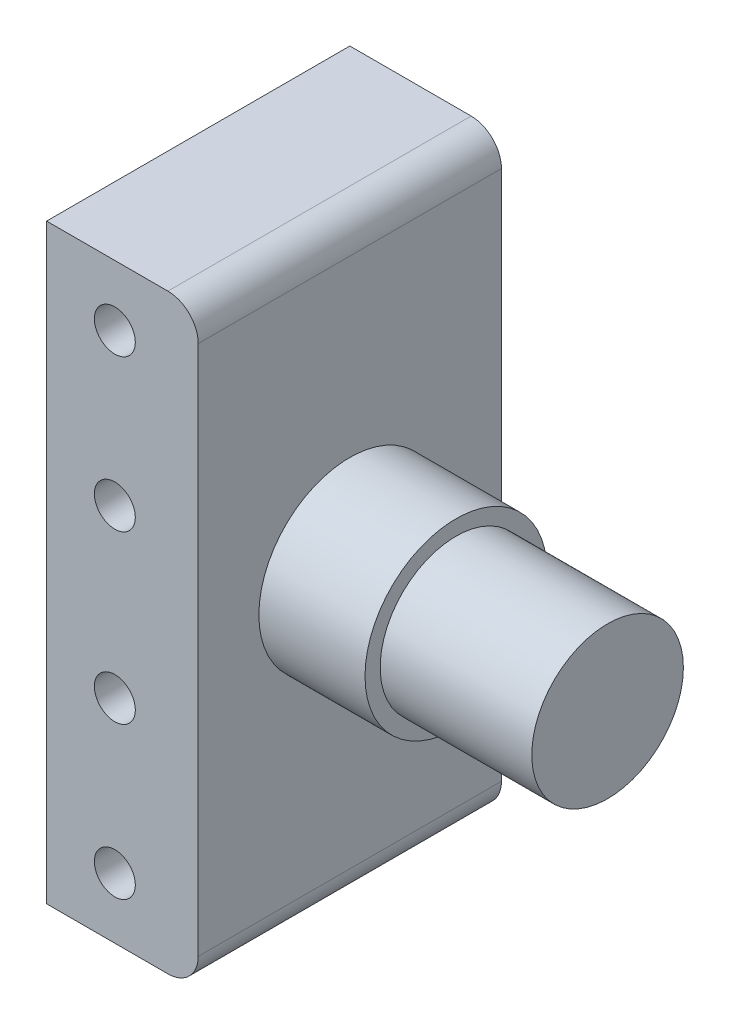
ISO-10303-21;
HEADER;
FILE_DESCRIPTION(('STEP AP214'),'2;1');
FILE_NAME('part.step','',(''),(''),'','','');
FILE_SCHEMA(('AUTOMOTIVE_DESIGN { 1 0 10303 214 1 1 1 1 }'));
ENDSEC;
DATA;
#1=APPLICATION_CONTEXT('core data for automotive mechanical design processes');
#2=APPLICATION_PROTOCOL_DEFINITION('international standard','automotive_design',2000,#1);
#3=PRODUCT_CONTEXT('',#1,'mechanical');
#4=PRODUCT('Part','Part','',(#3));
#5=PRODUCT_RELATED_PRODUCT_CATEGORY('part','',(#4));
#6=PRODUCT_DEFINITION_FORMATION('','',#4);
#7=PRODUCT_DEFINITION_CONTEXT('part definition',#1,'design');
#8=PRODUCT_DEFINITION('design','',#6,#7);
#9=PRODUCT_DEFINITION_SHAPE('','',#8);
#10=(LENGTH_UNIT() NAMED_UNIT(*) SI_UNIT(.MILLI.,.METRE.));
#11=(NAMED_UNIT(*) PLANE_ANGLE_UNIT() SI_UNIT($,.RADIAN.));
#12=(NAMED_UNIT(*) SI_UNIT($,.STERADIAN.) SOLID_ANGLE_UNIT());
#13=UNCERTAINTY_MEASURE_WITH_UNIT(LENGTH_MEASURE(1.E-05),#10,'distance_accuracy_value','');
#14=(GEOMETRIC_REPRESENTATION_CONTEXT(3) GLOBAL_UNCERTAINTY_ASSIGNED_CONTEXT((#13)) GLOBAL_UNIT_ASSIGNED_CONTEXT((#10,
#11,#12)) REPRESENTATION_CONTEXT('',''));
#15=CARTESIAN_POINT('',(0.,0.,0.));
#16=DIRECTION('',(0.,0.,1.));
#17=DIRECTION('',(1.,0.,0.));
#18=AXIS2_PLACEMENT_3D('',#15,#16,#17);
#19=CARTESIAN_POINT('',(-5.,-19.5,20.));
#20=DIRECTION('',(1.,0.,0.));
#21=DIRECTION('',(0.,0.,-1.));
#22=AXIS2_PLACEMENT_3D('',#19,#20,#21);
#23=PLANE('',#22);
#24=DIRECTION('',(0.,-1.,0.));
#25=VECTOR('',#24,1.);
#26=CARTESIAN_POINT('',(-5.,-19.5,0.));
#27=LINE('',#26,#25);
#28=CARTESIAN_POINT('',(-5.,19.5,0.));
#29=VERTEX_POINT('',#28);
#30=CARTESIAN_POINT('',(-5.,-19.5,0.));
#31=VERTEX_POINT('',#30);
#32=EDGE_CURVE('E118',#29,#31,#27,.T.);
#33=ORIENTED_EDGE('',*,*,#32,.T.);
#34=DIRECTION('',(0.,0.,-1.));
#35=VECTOR('',#34,1.);
#36=CARTESIAN_POINT('',(-5.,-19.5,20.));
#37=LINE('',#36,#35);
#38=CARTESIAN_POINT('',(-5.,-19.5,20.));
#39=VERTEX_POINT('',#38);
#40=EDGE_CURVE('E41',#39,#31,#37,.T.);
#41=ORIENTED_EDGE('',*,*,#40,.F.);
#42=DIRECTION('',(0.,-1.,0.));
#43=VECTOR('',#42,1.);
#44=CARTESIAN_POINT('',(-5.,-19.5,20.));
#45=LINE('',#44,#43);
#46=CARTESIAN_POINT('',(-5.,19.5,20.));
#47=VERTEX_POINT('',#46);
#48=EDGE_CURVE('E129',#47,#39,#45,.T.);
#49=ORIENTED_EDGE('',*,*,#48,.F.);
#50=DIRECTION('',(0.,0.,-1.));
#51=VECTOR('',#50,1.);
#52=CARTESIAN_POINT('',(-5.,19.5,20.));
#53=LINE('',#52,#51);
#54=EDGE_CURVE('E114',#47,#29,#53,.T.);
#55=ORIENTED_EDGE('',*,*,#54,.T.);
#56=EDGE_LOOP('',(#33,#41,#49,#55));
#57=FACE_BOUND('',#56,.T.);
#58=ADVANCED_FACE('F33',(#57),#23,.F.);
#59=CARTESIAN_POINT('',(-5.,-19.5,20.));
#60=DIRECTION('',(0.,1.,0.));
#61=DIRECTION('',(0.,0.,1.));
#62=AXIS2_PLACEMENT_3D('',#59,#60,#61);
#63=PLANE('',#62);
#64=DIRECTION('',(1.,0.,0.));
#65=VECTOR('',#64,1.);
#66=CARTESIAN_POINT('',(-5.,-19.5,0.));
#67=LINE('',#66,#65);
#68=CARTESIAN_POINT('',(3.,-19.5,0.));
#69=VERTEX_POINT('',#68);
#70=EDGE_CURVE('E121',#31,#69,#67,.T.);
#71=ORIENTED_EDGE('',*,*,#70,.T.);
#72=DIRECTION('',(0.,0.,-1.));
#73=VECTOR('',#72,1.);
#74=CARTESIAN_POINT('',(3.,-19.5,20.));
#75=LINE('',#74,#73);
#76=CARTESIAN_POINT('',(3.,-19.5,20.));
#77=VERTEX_POINT('',#76);
#78=EDGE_CURVE('E133',#77,#69,#75,.T.);
#79=ORIENTED_EDGE('',*,*,#78,.F.);
#80=DIRECTION('',(1.,0.,0.));
#81=VECTOR('',#80,1.);
#82=CARTESIAN_POINT('',(-5.,-19.5,20.));
#83=LINE('',#82,#81);
#84=EDGE_CURVE('E87',#39,#77,#83,.T.);
#85=ORIENTED_EDGE('',*,*,#84,.F.);
#86=ORIENTED_EDGE('',*,*,#40,.T.);
#87=EDGE_LOOP('',(#71,#79,#85,#86));
#88=FACE_BOUND('',#87,.T.);
#89=ADVANCED_FACE('F175',(#88),#63,.F.);
#90=CARTESIAN_POINT('',(3.,-17.5,20.));
#91=DIRECTION('',(0.,0.,-1.));
#92=DIRECTION('',(-1.,0.,0.));
#93=AXIS2_PLACEMENT_3D('',#90,#91,#92);
#94=CYLINDRICAL_SURFACE('',#93,2.);
#95=CARTESIAN_POINT('',(3.,-17.5,0.));
#96=DIRECTION('',(0.,0.,1.));
#97=DIRECTION('',(1.,0.,0.));
#98=AXIS2_PLACEMENT_3D('',#95,#96,#97);
#99=CIRCLE('',#98,2.);
#100=CARTESIAN_POINT('',(5.,-17.5,0.));
#101=VERTEX_POINT('',#100);
#102=EDGE_CURVE('E124',#69,#101,#99,.T.);
#103=ORIENTED_EDGE('',*,*,#102,.T.);
#104=DIRECTION('',(0.,0.,-1.));
#105=VECTOR('',#104,1.);
#106=CARTESIAN_POINT('',(5.,-17.5,20.));
#107=LINE('',#106,#105);
#108=CARTESIAN_POINT('',(5.,-17.5,20.));
#109=VERTEX_POINT('',#108);
#110=EDGE_CURVE('E109',#109,#101,#107,.T.);
#111=ORIENTED_EDGE('',*,*,#110,.F.);
#112=CARTESIAN_POINT('',(3.,-17.5,20.));
#113=DIRECTION('',(0.,0.,1.));
#114=DIRECTION('',(1.,0.,0.));
#115=AXIS2_PLACEMENT_3D('',#112,#113,#114);
#116=CIRCLE('',#115,2.);
#117=EDGE_CURVE('E100',#77,#109,#116,.T.);
#118=ORIENTED_EDGE('',*,*,#117,.F.);
#119=ORIENTED_EDGE('',*,*,#78,.T.);
#120=EDGE_LOOP('',(#103,#111,#118,#119));
#121=FACE_BOUND('',#120,.T.);
#122=ADVANCED_FACE('F178',(#121),#94,.T.);
#123=CARTESIAN_POINT('',(5.,-17.5,20.));
#124=DIRECTION('',(-1.,0.,0.));
#125=DIRECTION('',(0.,0.,1.));
#126=AXIS2_PLACEMENT_3D('',#123,#124,#125);
#127=PLANE('',#126);
#128=CARTESIAN_POINT('',(5.,0.,10.));
#129=DIRECTION('',(-1.,0.,0.));
#130=DIRECTION('',(0.,0.,1.));
#131=AXIS2_PLACEMENT_3D('',#128,#129,#130);
#132=CIRCLE('',#131,6.);
#133=CARTESIAN_POINT('',(5.,0.,16.));
#134=VERTEX_POINT('',#133);
#135=EDGE_CURVE('E11',#134,#134,#132,.F.);
#136=ORIENTED_EDGE('',*,*,#135,.F.);
#137=EDGE_LOOP('',(#136));
#138=FACE_BOUND('',#137,.T.);
#139=DIRECTION('',(0.,1.,0.));
#140=VECTOR('',#139,1.);
#141=CARTESIAN_POINT('',(5.,-17.5,0.));
#142=LINE('',#141,#140);
#143=CARTESIAN_POINT('',(5.,17.5,0.));
#144=VERTEX_POINT('',#143);
#145=EDGE_CURVE('E108',#101,#144,#142,.T.);
#146=ORIENTED_EDGE('',*,*,#145,.T.);
#147=DIRECTION('',(0.,0.,-1.));
#148=VECTOR('',#147,1.);
#149=CARTESIAN_POINT('',(5.,17.5,20.));
#150=LINE('',#149,#148);
#151=CARTESIAN_POINT('',(5.,17.5,20.));
#152=VERTEX_POINT('',#151);
#153=EDGE_CURVE('E105',#152,#144,#150,.T.);
#154=ORIENTED_EDGE('',*,*,#153,.F.);
#155=DIRECTION('',(0.,1.,0.));
#156=VECTOR('',#155,1.);
#157=CARTESIAN_POINT('',(5.,-17.5,20.));
#158=LINE('',#157,#156);
#159=EDGE_CURVE('E94',#109,#152,#158,.T.);
#160=ORIENTED_EDGE('',*,*,#159,.F.);
#161=ORIENTED_EDGE('',*,*,#110,.T.);
#162=EDGE_LOOP('',(#146,#154,#160,#161));
#163=FACE_BOUND('',#162,.T.);
#164=ADVANCED_FACE('F106',(#138,#163),#127,.F.);
#165=CARTESIAN_POINT('',(3.,17.5,20.));
#166=DIRECTION('',(0.,0.,-1.));
#167=DIRECTION('',(-1.,0.,0.));
#168=AXIS2_PLACEMENT_3D('',#165,#166,#167);
#169=CYLINDRICAL_SURFACE('',#168,2.);
#170=CARTESIAN_POINT('',(3.,17.5,0.));
#171=DIRECTION('',(0.,0.,1.));
#172=DIRECTION('',(-1.,0.,0.));
#173=AXIS2_PLACEMENT_3D('',#170,#171,#172);
#174=CIRCLE('',#173,2.);
#175=CARTESIAN_POINT('',(3.,19.5,0.));
#176=VERTEX_POINT('',#175);
#177=EDGE_CURVE('E72',#144,#176,#174,.T.);
#178=ORIENTED_EDGE('',*,*,#177,.T.);
#179=DIRECTION('',(0.,0.,-1.));
#180=VECTOR('',#179,1.);
#181=CARTESIAN_POINT('',(3.,19.5,20.));
#182=LINE('',#181,#180);
#183=CARTESIAN_POINT('',(3.,19.5,20.));
#184=VERTEX_POINT('',#183);
#185=EDGE_CURVE('E110',#184,#176,#182,.T.);
#186=ORIENTED_EDGE('',*,*,#185,.F.);
#187=CARTESIAN_POINT('',(3.,17.5,20.));
#188=DIRECTION('',(0.,0.,1.));
#189=DIRECTION('',(-1.,0.,0.));
#190=AXIS2_PLACEMENT_3D('',#187,#188,#189);
#191=CIRCLE('',#190,2.);
#192=EDGE_CURVE('E98',#152,#184,#191,.T.);
#193=ORIENTED_EDGE('',*,*,#192,.F.);
#194=ORIENTED_EDGE('',*,*,#153,.T.);
#195=EDGE_LOOP('',(#178,#186,#193,#194));
#196=FACE_BOUND('',#195,.T.);
#197=ADVANCED_FACE('F112',(#196),#169,.T.);
#198=CARTESIAN_POINT('',(-5.,19.5,20.));
#199=DIRECTION('',(0.,-1.,0.));
#200=DIRECTION('',(0.,0.,-1.));
#201=AXIS2_PLACEMENT_3D('',#198,#199,#200);
#202=PLANE('',#201);
#203=DIRECTION('',(-1.,0.,0.));
#204=VECTOR('',#203,1.);
#205=CARTESIAN_POINT('',(-5.,19.5,0.));
#206=LINE('',#205,#204);
#207=EDGE_CURVE('E78',#176,#29,#206,.T.);
#208=ORIENTED_EDGE('',*,*,#207,.T.);
#209=ORIENTED_EDGE('',*,*,#54,.F.);
#210=DIRECTION('',(-1.,0.,0.));
#211=VECTOR('',#210,1.);
#212=CARTESIAN_POINT('',(-5.,19.5,20.));
#213=LINE('',#212,#211);
#214=EDGE_CURVE('E49',#184,#47,#213,.T.);
#215=ORIENTED_EDGE('',*,*,#214,.F.);
#216=ORIENTED_EDGE('',*,*,#185,.T.);
#217=EDGE_LOOP('',(#208,#209,#215,#216));
#218=FACE_BOUND('',#217,.T.);
#219=ADVANCED_FACE('F183',(#218),#202,.F.);
#220=CARTESIAN_POINT('',(3.,17.5,20.));
#221=DIRECTION('',(0.,0.,-1.));
#222=DIRECTION('',(-1.,0.,0.));
#223=AXIS2_PLACEMENT_3D('',#220,#221,#222);
#224=PLANE('',#223);
#225=CARTESIAN_POINT('',(-0.5,15.5,20.));
#226=DIRECTION('',(0.,0.,1.));
#227=DIRECTION('',(1.,0.,0.));
#228=AXIS2_PLACEMENT_3D('',#225,#226,#227);
#229=CIRCLE('',#228,1.35);
#230=CARTESIAN_POINT('',(0.85,15.5,20.));
#231=VERTEX_POINT('',#230);
#232=EDGE_CURVE('E152',#231,#231,#229,.T.);
#233=ORIENTED_EDGE('',*,*,#232,.F.);
#234=EDGE_LOOP('',(#233));
#235=FACE_BOUND('',#234,.T.);
#236=CARTESIAN_POINT('',(-0.499999999999896,-5.5,20.));
#237=DIRECTION('',(0.,0.,1.));
#238=DIRECTION('',(-1.,0.,0.));
#239=AXIS2_PLACEMENT_3D('',#236,#237,#238);
#240=CIRCLE('',#239,1.35);
#241=CARTESIAN_POINT('',(-1.8499999999999,-5.5,20.));
#242=VERTEX_POINT('',#241);
#243=EDGE_CURVE('E143',#242,#242,#240,.T.);
#244=ORIENTED_EDGE('',*,*,#243,.F.);
#245=EDGE_LOOP('',(#244));
#246=FACE_BOUND('',#245,.T.);
#247=CARTESIAN_POINT('',(-0.5,-15.5,20.));
#248=DIRECTION('',(0.,0.,1.));
#249=DIRECTION('',(-1.,0.,0.));
#250=AXIS2_PLACEMENT_3D('',#247,#248,#249);
#251=CIRCLE('',#250,1.35);
#252=CARTESIAN_POINT('',(-1.85,-15.5,20.));
#253=VERTEX_POINT('',#252);
#254=EDGE_CURVE('E159',#253,#253,#251,.T.);
#255=ORIENTED_EDGE('',*,*,#254,.F.);
#256=EDGE_LOOP('',(#255));
#257=FACE_BOUND('',#256,.T.);
#258=CARTESIAN_POINT('',(-0.499999999999896,5.5,20.));
#259=DIRECTION('',(0.,0.,1.));
#260=DIRECTION('',(1.,0.,0.));
#261=AXIS2_PLACEMENT_3D('',#258,#259,#260);
#262=CIRCLE('',#261,1.35);
#263=CARTESIAN_POINT('',(0.850000000000104,5.5,20.));
#264=VERTEX_POINT('',#263);
#265=EDGE_CURVE('E164',#264,#264,#262,.T.);
#266=ORIENTED_EDGE('',*,*,#265,.F.);
#267=EDGE_LOOP('',(#266));
#268=FACE_BOUND('',#267,.T.);
#269=ORIENTED_EDGE('',*,*,#48,.T.);
#270=ORIENTED_EDGE('',*,*,#84,.T.);
#271=ORIENTED_EDGE('',*,*,#117,.T.);
#272=ORIENTED_EDGE('',*,*,#159,.T.);
#273=ORIENTED_EDGE('',*,*,#192,.T.);
#274=ORIENTED_EDGE('',*,*,#214,.T.);
#275=EDGE_LOOP('',(#269,#270,#271,#272,#273,#274));
#276=FACE_BOUND('',#275,.T.);
#277=ADVANCED_FACE('F96',(#235,#246,#257,#268,#276),#224,.F.);
#278=CARTESIAN_POINT('',(3.,17.5,0.));
#279=DIRECTION('',(0.,0.,-1.));
#280=DIRECTION('',(-1.,0.,0.));
#281=AXIS2_PLACEMENT_3D('',#278,#279,#280);
#282=PLANE('',#281);
#283=ORIENTED_EDGE('',*,*,#32,.F.);
#284=ORIENTED_EDGE('',*,*,#207,.F.);
#285=ORIENTED_EDGE('',*,*,#177,.F.);
#286=ORIENTED_EDGE('',*,*,#145,.F.);
#287=ORIENTED_EDGE('',*,*,#102,.F.);
#288=ORIENTED_EDGE('',*,*,#70,.F.);
#289=EDGE_LOOP('',(#283,#284,#285,#286,#287,#288));
#290=FACE_BOUND('',#289,.T.);
#291=ADVANCED_FACE('F181',(#290),#282,.T.);
#292=CARTESIAN_POINT('',(-0.499999999999896,5.5,8.));
#293=DIRECTION('',(0.,0.,1.));
#294=DIRECTION('',(1.,0.,0.));
#295=AXIS2_PLACEMENT_3D('',#292,#293,#294);
#296=CYLINDRICAL_SURFACE('',#295,1.35);
#297=CARTESIAN_POINT('',(-0.499999999999896,5.5,8.));
#298=DIRECTION('',(0.,0.,1.));
#299=DIRECTION('',(1.,0.,0.));
#300=AXIS2_PLACEMENT_3D('',#297,#298,#299);
#301=CIRCLE('',#300,1.35);
#302=CARTESIAN_POINT('',(0.850000000000104,5.5,8.));
#303=VERTEX_POINT('',#302);
#304=EDGE_CURVE('E155',#303,#303,#301,.T.);
#305=ORIENTED_EDGE('',*,*,#304,.F.);
#306=EDGE_LOOP('',(#305));
#307=FACE_BOUND('',#306,.T.);
#308=ORIENTED_EDGE('',*,*,#265,.T.);
#309=EDGE_LOOP('',(#308));
#310=FACE_BOUND('',#309,.T.);
#311=ADVANCED_FACE('F249',(#307,#310),#296,.F.);
#312=CARTESIAN_POINT('',(-0.499999999999896,5.5,8.));
#313=DIRECTION('',(0.,0.,1.));
#314=DIRECTION('',(1.,0.,0.));
#315=AXIS2_PLACEMENT_3D('',#312,#313,#314);
#316=PLANE('',#315);
#317=ORIENTED_EDGE('',*,*,#304,.T.);
#318=EDGE_LOOP('',(#317));
#319=FACE_BOUND('',#318,.T.);
#320=ADVANCED_FACE('F245',(#319),#316,.T.);
#321=CARTESIAN_POINT('',(-0.5,-15.5,8.));
#322=DIRECTION('',(0.,0.,1.));
#323=DIRECTION('',(1.,0.,0.));
#324=AXIS2_PLACEMENT_3D('',#321,#322,#323);
#325=CYLINDRICAL_SURFACE('',#324,1.35);
#326=CARTESIAN_POINT('',(-0.5,-15.5,8.));
#327=DIRECTION('',(0.,0.,1.));
#328=DIRECTION('',(-1.,0.,0.));
#329=AXIS2_PLACEMENT_3D('',#326,#327,#328);
#330=CIRCLE('',#329,1.35);
#331=CARTESIAN_POINT('',(-1.85,-15.5,8.));
#332=VERTEX_POINT('',#331);
#333=EDGE_CURVE('E167',#332,#332,#330,.T.);
#334=ORIENTED_EDGE('',*,*,#333,.F.);
#335=EDGE_LOOP('',(#334));
#336=FACE_BOUND('',#335,.T.);
#337=ORIENTED_EDGE('',*,*,#254,.T.);
#338=EDGE_LOOP('',(#337));
#339=FACE_BOUND('',#338,.T.);
#340=ADVANCED_FACE('F248',(#336,#339),#325,.F.);
#341=CARTESIAN_POINT('',(-0.5,-15.5,8.));
#342=DIRECTION('',(0.,0.,-1.));
#343=DIRECTION('',(-1.,0.,0.));
#344=AXIS2_PLACEMENT_3D('',#341,#342,#343);
#345=PLANE('',#344);
#346=ORIENTED_EDGE('',*,*,#333,.T.);
#347=EDGE_LOOP('',(#346));
#348=FACE_BOUND('',#347,.T.);
#349=ADVANCED_FACE('F243',(#348),#345,.F.);
#350=CARTESIAN_POINT('',(-0.499999999999896,-5.5,8.));
#351=DIRECTION('',(0.,0.,1.));
#352=DIRECTION('',(1.,0.,0.));
#353=AXIS2_PLACEMENT_3D('',#350,#351,#352);
#354=CYLINDRICAL_SURFACE('',#353,1.35);
#355=CARTESIAN_POINT('',(-0.499999999999896,-5.5,8.));
#356=DIRECTION('',(0.,0.,1.));
#357=DIRECTION('',(-1.,0.,0.));
#358=AXIS2_PLACEMENT_3D('',#355,#356,#357);
#359=CIRCLE('',#358,1.35);
#360=CARTESIAN_POINT('',(-1.8499999999999,-5.5,8.));
#361=VERTEX_POINT('',#360);
#362=EDGE_CURVE('E156',#361,#361,#359,.T.);
#363=ORIENTED_EDGE('',*,*,#362,.F.);
#364=EDGE_LOOP('',(#363));
#365=FACE_BOUND('',#364,.T.);
#366=ORIENTED_EDGE('',*,*,#243,.T.);
#367=EDGE_LOOP('',(#366));
#368=FACE_BOUND('',#367,.T.);
#369=ADVANCED_FACE('F239',(#365,#368),#354,.F.);
#370=CARTESIAN_POINT('',(-0.499999999999896,-5.5,8.));
#371=DIRECTION('',(0.,0.,-1.));
#372=DIRECTION('',(-1.,0.,0.));
#373=AXIS2_PLACEMENT_3D('',#370,#371,#372);
#374=PLANE('',#373);
#375=ORIENTED_EDGE('',*,*,#362,.T.);
#376=EDGE_LOOP('',(#375));
#377=FACE_BOUND('',#376,.T.);
#378=ADVANCED_FACE('F235',(#377),#374,.F.);
#379=CARTESIAN_POINT('',(-0.5,15.5,8.));
#380=DIRECTION('',(0.,0.,1.));
#381=DIRECTION('',(1.,0.,0.));
#382=AXIS2_PLACEMENT_3D('',#379,#380,#381);
#383=CYLINDRICAL_SURFACE('',#382,1.35);
#384=CARTESIAN_POINT('',(-0.5,15.5,8.));
#385=DIRECTION('',(0.,0.,1.));
#386=DIRECTION('',(1.,0.,0.));
#387=AXIS2_PLACEMENT_3D('',#384,#385,#386);
#388=CIRCLE('',#387,1.35);
#389=CARTESIAN_POINT('',(0.85,15.5,8.));
#390=VERTEX_POINT('',#389);
#391=EDGE_CURVE('E122',#390,#390,#388,.T.);
#392=ORIENTED_EDGE('',*,*,#391,.F.);
#393=EDGE_LOOP('',(#392));
#394=FACE_BOUND('',#393,.T.);
#395=ORIENTED_EDGE('',*,*,#232,.T.);
#396=EDGE_LOOP('',(#395));
#397=FACE_BOUND('',#396,.T.);
#398=ADVANCED_FACE('F223',(#394,#397),#383,.F.);
#399=CARTESIAN_POINT('',(-0.5,15.5,8.));
#400=DIRECTION('',(0.,0.,1.));
#401=DIRECTION('',(1.,0.,0.));
#402=AXIS2_PLACEMENT_3D('',#399,#400,#401);
#403=PLANE('',#402);
#404=ORIENTED_EDGE('',*,*,#391,.T.);
#405=EDGE_LOOP('',(#404));
#406=FACE_BOUND('',#405,.T.);
#407=ADVANCED_FACE('F214',(#406),#403,.T.);
#408=CARTESIAN_POINT('',(12.,0.,10.));
#409=DIRECTION('',(-1.,0.,0.));
#410=DIRECTION('',(0.,0.,1.));
#411=AXIS2_PLACEMENT_3D('',#408,#409,#410);
#412=CYLINDRICAL_SURFACE('',#411,6.);
#413=CARTESIAN_POINT('',(12.,0.,10.));
#414=DIRECTION('',(1.,0.,0.));
#415=DIRECTION('',(0.,0.,-1.));
#416=AXIS2_PLACEMENT_3D('',#413,#414,#415);
#417=CIRCLE('',#416,6.);
#418=CARTESIAN_POINT('',(12.,0.,4.));
#419=VERTEX_POINT('',#418);
#420=EDGE_CURVE('E139',#419,#419,#417,.T.);
#421=ORIENTED_EDGE('',*,*,#420,.F.);
#422=EDGE_LOOP('',(#421));
#423=FACE_BOUND('',#422,.T.);
#424=ORIENTED_EDGE('',*,*,#135,.T.);
#425=EDGE_LOOP('',(#424));
#426=FACE_BOUND('',#425,.T.);
#427=ADVANCED_FACE('F211',(#423,#426),#412,.T.);
#428=CARTESIAN_POINT('',(12.,0.,10.));
#429=DIRECTION('',(1.,0.,0.));
#430=DIRECTION('',(0.,0.,-1.));
#431=AXIS2_PLACEMENT_3D('',#428,#429,#430);
#432=PLANE('',#431);
#433=CARTESIAN_POINT('',(12.,0.,10.));
#434=DIRECTION('',(1.,0.,0.));
#435=DIRECTION('',(0.,0.,-1.));
#436=AXIS2_PLACEMENT_3D('',#433,#434,#435);
#437=CIRCLE('',#436,5.);
#438=CARTESIAN_POINT('',(12.,0.,5.));
#439=VERTEX_POINT('',#438);
#440=EDGE_CURVE('E136',#439,#439,#437,.T.);
#441=ORIENTED_EDGE('',*,*,#440,.F.);
#442=EDGE_LOOP('',(#441));
#443=FACE_BOUND('',#442,.T.);
#444=ORIENTED_EDGE('',*,*,#420,.T.);
#445=EDGE_LOOP('',(#444));
#446=FACE_BOUND('',#445,.T.);
#447=ADVANCED_FACE('F213',(#443,#446),#432,.T.);
#448=CARTESIAN_POINT('',(22.,0.,10.));
#449=DIRECTION('',(1.,0.,0.));
#450=DIRECTION('',(0.,0.,-1.));
#451=AXIS2_PLACEMENT_3D('',#448,#449,#450);
#452=PLANE('',#451);
#453=CARTESIAN_POINT('',(22.,0.,10.));
#454=DIRECTION('',(1.,0.,0.));
#455=DIRECTION('',(0.,0.,-1.));
#456=AXIS2_PLACEMENT_3D('',#453,#454,#455);
#457=CIRCLE('',#456,5.);
#458=CARTESIAN_POINT('',(22.,0.,5.));
#459=VERTEX_POINT('',#458);
#460=EDGE_CURVE('E138',#459,#459,#457,.T.);
#461=ORIENTED_EDGE('',*,*,#460,.T.);
#462=EDGE_LOOP('',(#461));
#463=FACE_BOUND('',#462,.T.);
#464=ADVANCED_FACE('F220',(#463),#452,.T.);
#465=CARTESIAN_POINT('',(22.,0.,10.));
#466=DIRECTION('',(-1.,0.,0.));
#467=DIRECTION('',(0.,0.,1.));
#468=AXIS2_PLACEMENT_3D('',#465,#466,#467);
#469=CYLINDRICAL_SURFACE('',#468,5.);
#470=ORIENTED_EDGE('',*,*,#440,.T.);
#471=EDGE_LOOP('',(#470));
#472=FACE_BOUND('',#471,.T.);
#473=ORIENTED_EDGE('',*,*,#460,.F.);
#474=EDGE_LOOP('',(#473));
#475=FACE_BOUND('',#474,.T.);
#476=ADVANCED_FACE('F229',(#472,#475),#469,.T.);
#477=CLOSED_SHELL('',(#58,#89,#122,#164,#197,#219,#277,#291,#311,#320,#340,#349,#369,#378,#398,
#407,#427,#447,#464,#476));
#478=MANIFOLD_SOLID_BREP('B2',#477);
#479=ADVANCED_BREP_SHAPE_REPRESENTATION('',(#18,#478),#14);
#480=SHAPE_DEFINITION_REPRESENTATION(#9,#479);
ENDSEC;
END-ISO-10303-21;
